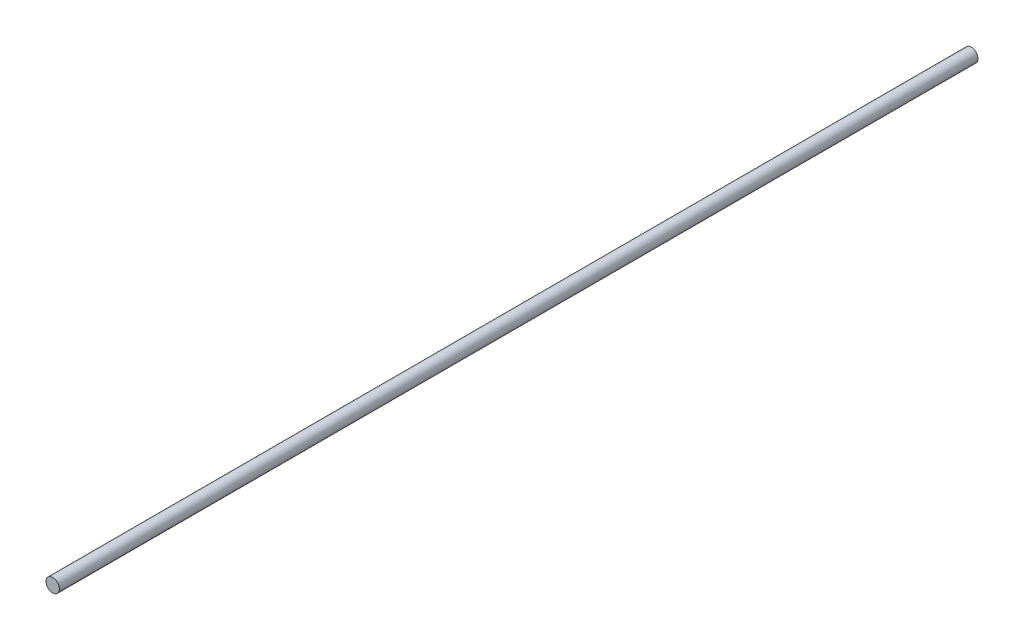
ISO-10303-21;
HEADER;
FILE_DESCRIPTION(('STEP AP214'),'2;1');
FILE_NAME('part.step','',(''),(''),'','','');
FILE_SCHEMA(('AUTOMOTIVE_DESIGN { 1 0 10303 214 1 1 1 1 }'));
ENDSEC;
DATA;
#1=APPLICATION_CONTEXT('core data for automotive mechanical design processes');
#2=APPLICATION_PROTOCOL_DEFINITION('international standard','automotive_design',2000,#1);
#3=PRODUCT_CONTEXT('',#1,'mechanical');
#4=PRODUCT('Part','Part','',(#3));
#5=PRODUCT_RELATED_PRODUCT_CATEGORY('part','',(#4));
#6=PRODUCT_DEFINITION_FORMATION('','',#4);
#7=PRODUCT_DEFINITION_CONTEXT('part definition',#1,'design');
#8=PRODUCT_DEFINITION('design','',#6,#7);
#9=PRODUCT_DEFINITION_SHAPE('','',#8);
#10=(LENGTH_UNIT() NAMED_UNIT(*) SI_UNIT(.MILLI.,.METRE.));
#11=(NAMED_UNIT(*) PLANE_ANGLE_UNIT() SI_UNIT($,.RADIAN.));
#12=(NAMED_UNIT(*) SI_UNIT($,.STERADIAN.) SOLID_ANGLE_UNIT());
#13=UNCERTAINTY_MEASURE_WITH_UNIT(LENGTH_MEASURE(1.E-05),#10,'distance_accuracy_value','');
#14=(GEOMETRIC_REPRESENTATION_CONTEXT(3) GLOBAL_UNCERTAINTY_ASSIGNED_CONTEXT((#13)) GLOBAL_UNIT_ASSIGNED_CONTEXT((#10,
#11,#12)) REPRESENTATION_CONTEXT('',''));
#15=CARTESIAN_POINT('',(0.,0.,0.));
#16=DIRECTION('',(0.,0.,1.));
#17=DIRECTION('',(1.,0.,0.));
#18=AXIS2_PLACEMENT_3D('',#15,#16,#17);
#19=CARTESIAN_POINT('',(0.,0.,550.));
#20=DIRECTION('',(0.,0.,-1.));
#21=DIRECTION('',(-1.,0.,0.));
#22=AXIS2_PLACEMENT_3D('',#19,#20,#21);
#23=CYLINDRICAL_SURFACE('',#22,4.);
#24=CARTESIAN_POINT('',(0.,0.,550.));
#25=DIRECTION('',(0.,0.,1.));
#26=DIRECTION('',(1.,0.,0.));
#27=AXIS2_PLACEMENT_3D('',#24,#25,#26);
#28=CIRCLE('',#27,4.);
#29=CARTESIAN_POINT('',(4.,0.,550.));
#30=VERTEX_POINT('',#29);
#31=EDGE_CURVE('E10',#30,#30,#28,.T.);
#32=ORIENTED_EDGE('',*,*,#31,.F.);
#33=EDGE_LOOP('',(#32));
#34=FACE_BOUND('',#33,.T.);
#35=CARTESIAN_POINT('',(0.,0.,0.));
#36=DIRECTION('',(0.,0.,1.));
#37=DIRECTION('',(1.,0.,0.));
#38=AXIS2_PLACEMENT_3D('',#35,#36,#37);
#39=CIRCLE('',#38,4.);
#40=CARTESIAN_POINT('',(4.,0.,0.));
#41=VERTEX_POINT('',#40);
#42=EDGE_CURVE('E40',#41,#41,#39,.T.);
#43=ORIENTED_EDGE('',*,*,#42,.T.);
#44=EDGE_LOOP('',(#43));
#45=FACE_BOUND('',#44,.T.);
#46=ADVANCED_FACE('F37',(#34,#45),#23,.T.);
#47=CARTESIAN_POINT('',(0.,0.,550.));
#48=DIRECTION('',(0.,0.,1.));
#49=DIRECTION('',(1.,0.,0.));
#50=AXIS2_PLACEMENT_3D('',#47,#48,#49);
#51=PLANE('',#50);
#52=ORIENTED_EDGE('',*,*,#31,.T.);
#53=EDGE_LOOP('',(#52));
#54=FACE_BOUND('',#53,.T.);
#55=ADVANCED_FACE('F54',(#54),#51,.T.);
#56=CARTESIAN_POINT('',(0.,0.,0.));
#57=DIRECTION('',(0.,0.,1.));
#58=DIRECTION('',(1.,0.,0.));
#59=AXIS2_PLACEMENT_3D('',#56,#57,#58);
#60=PLANE('',#59);
#61=ORIENTED_EDGE('',*,*,#42,.F.);
#62=EDGE_LOOP('',(#61));
#63=FACE_BOUND('',#62,.T.);
#64=ADVANCED_FACE('F52',(#63),#60,.F.);
#65=CLOSED_SHELL('',(#46,#55,#64));
#66=MANIFOLD_SOLID_BREP('B2',#65);
#67=ADVANCED_BREP_SHAPE_REPRESENTATION('',(#18,#66),#14);
#68=SHAPE_DEFINITION_REPRESENTATION(#9,#67);
ENDSEC;
END-ISO-10303-21;
